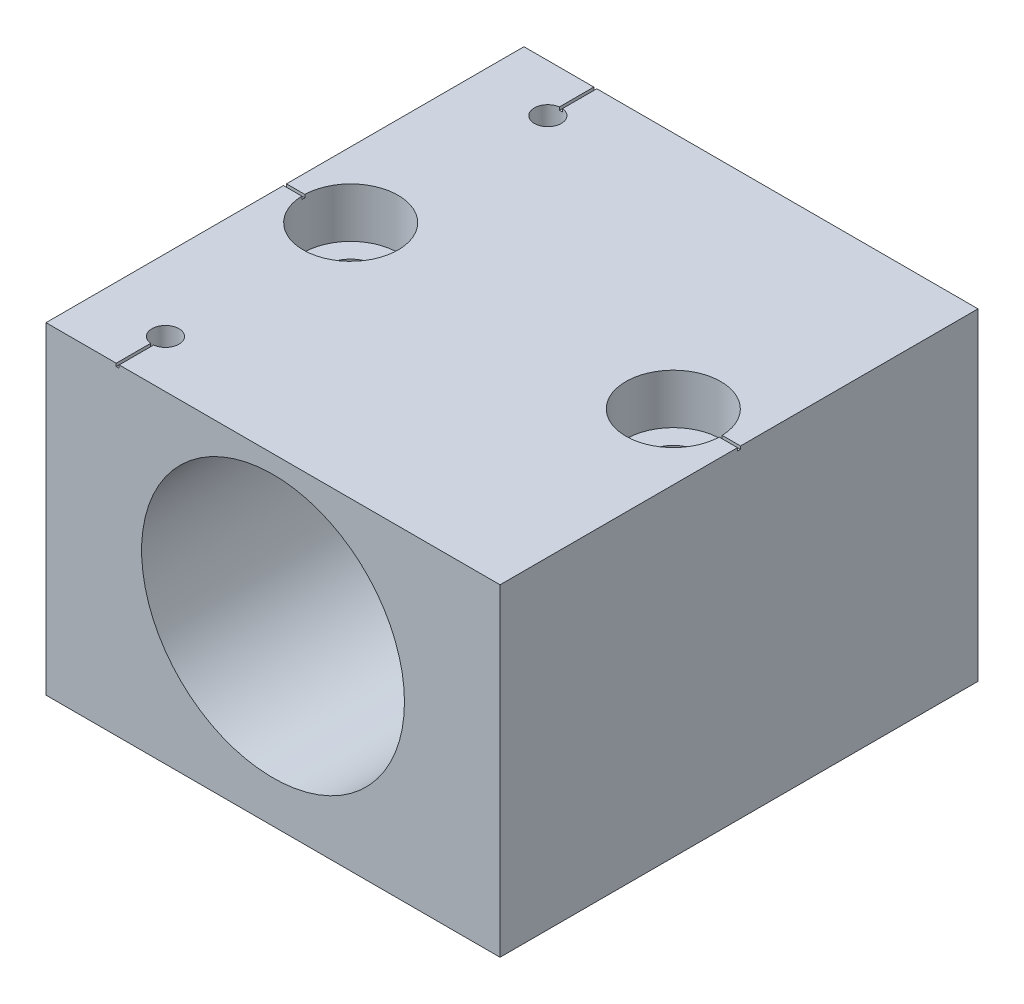
ISO-10303-21;
HEADER;
FILE_DESCRIPTION(('STEP AP214'),'2;1');
FILE_NAME('part.step','',(''),(''),'','','');
FILE_SCHEMA(('AUTOMOTIVE_DESIGN { 1 0 10303 214 1 1 1 1 }'));
ENDSEC;
DATA;
#1=APPLICATION_CONTEXT('core data for automotive mechanical design processes');
#2=APPLICATION_PROTOCOL_DEFINITION('international standard','automotive_design',2000,#1);
#3=PRODUCT_CONTEXT('',#1,'mechanical');
#4=PRODUCT('Part','Part','',(#3));
#5=PRODUCT_RELATED_PRODUCT_CATEGORY('part','',(#4));
#6=PRODUCT_DEFINITION_FORMATION('','',#4);
#7=PRODUCT_DEFINITION_CONTEXT('part definition',#1,'design');
#8=PRODUCT_DEFINITION('design','',#6,#7);
#9=PRODUCT_DEFINITION_SHAPE('','',#8);
#10=(LENGTH_UNIT() NAMED_UNIT(*) SI_UNIT(.MILLI.,.METRE.));
#11=(NAMED_UNIT(*) PLANE_ANGLE_UNIT() SI_UNIT($,.RADIAN.));
#12=(NAMED_UNIT(*) SI_UNIT($,.STERADIAN.) SOLID_ANGLE_UNIT());
#13=UNCERTAINTY_MEASURE_WITH_UNIT(LENGTH_MEASURE(1.E-05),#10,'distance_accuracy_value','');
#14=(GEOMETRIC_REPRESENTATION_CONTEXT(3) GLOBAL_UNCERTAINTY_ASSIGNED_CONTEXT((#13)) GLOBAL_UNIT_ASSIGNED_CONTEXT((#10,
#11,#12)) REPRESENTATION_CONTEXT('',''));
#15=CARTESIAN_POINT('',(0.,0.,0.));
#16=DIRECTION('',(0.,0.,1.));
#17=DIRECTION('',(1.,0.,0.));
#18=AXIS2_PLACEMENT_3D('',#15,#16,#17);
#19=CARTESIAN_POINT('',(-19.,0.,20.));
#20=DIRECTION('',(1.,0.,0.));
#21=DIRECTION('',(0.,0.,-1.));
#22=AXIS2_PLACEMENT_3D('',#19,#20,#21);
#23=PLANE('',#22);
#24=DIRECTION('',(0.,0.,1.));
#25=VECTOR('',#24,1.);
#26=CARTESIAN_POINT('',(-19.,26.75,-0.124999999999956));
#27=LINE('',#26,#25);
#28=CARTESIAN_POINT('',(-19.,26.75,-0.124999999999956));
#29=VERTEX_POINT('',#28);
#30=CARTESIAN_POINT('',(-19.,26.75,0.125000000000043));
#31=VERTEX_POINT('',#30);
#32=EDGE_CURVE('E420',#29,#31,#27,.T.);
#33=ORIENTED_EDGE('',*,*,#32,.F.);
#34=DIRECTION('',(0.,1.,0.));
#35=VECTOR('',#34,1.);
#36=CARTESIAN_POINT('',(-19.,26.75,-0.124999999999956));
#37=LINE('',#36,#35);
#38=CARTESIAN_POINT('',(-19.,27.,-0.124999999999956));
#39=VERTEX_POINT('',#38);
#40=EDGE_CURVE('E347',#29,#39,#37,.T.);
#41=ORIENTED_EDGE('',*,*,#40,.T.);
#42=DIRECTION('',(0.,0.,-1.));
#43=VECTOR('',#42,1.);
#44=CARTESIAN_POINT('',(-19.,27.,20.));
#45=LINE('',#44,#43);
#46=CARTESIAN_POINT('',(-19.,27.,-20.));
#47=VERTEX_POINT('',#46);
#48=EDGE_CURVE('E367',#39,#47,#45,.T.);
#49=ORIENTED_EDGE('',*,*,#48,.T.);
#50=DIRECTION('',(0.,-1.,0.));
#51=VECTOR('',#50,1.);
#52=CARTESIAN_POINT('',(-19.,0.,-20.));
#53=LINE('',#52,#51);
#54=CARTESIAN_POINT('',(-19.,0.,-20.));
#55=VERTEX_POINT('',#54);
#56=EDGE_CURVE('E511',#47,#55,#53,.T.);
#57=ORIENTED_EDGE('',*,*,#56,.T.);
#58=DIRECTION('',(0.,0.,-1.));
#59=VECTOR('',#58,1.);
#60=CARTESIAN_POINT('',(-19.,0.,20.));
#61=LINE('',#60,#59);
#62=CARTESIAN_POINT('',(-19.,0.,20.));
#63=VERTEX_POINT('',#62);
#64=EDGE_CURVE('E379',#63,#55,#61,.T.);
#65=ORIENTED_EDGE('',*,*,#64,.F.);
#66=DIRECTION('',(0.,-1.,0.));
#67=VECTOR('',#66,1.);
#68=CARTESIAN_POINT('',(-19.,0.,20.));
#69=LINE('',#68,#67);
#70=CARTESIAN_POINT('',(-19.,27.,20.));
#71=VERTEX_POINT('',#70);
#72=EDGE_CURVE('E365',#71,#63,#69,.T.);
#73=ORIENTED_EDGE('',*,*,#72,.F.);
#74=CARTESIAN_POINT('',(-19.,27.,0.125000000000044));
#75=VERTEX_POINT('',#74);
#76=EDGE_CURVE('E356',#71,#75,#45,.T.);
#77=ORIENTED_EDGE('',*,*,#76,.T.);
#78=DIRECTION('',(0.,1.,0.));
#79=VECTOR('',#78,1.);
#80=CARTESIAN_POINT('',(-19.,26.75,0.125000000000043));
#81=LINE('',#80,#79);
#82=EDGE_CURVE('E339',#31,#75,#81,.T.);
#83=ORIENTED_EDGE('',*,*,#82,.F.);
#84=EDGE_LOOP('',(#33,#41,#49,#57,#65,#73,#77,#83));
#85=FACE_BOUND('',#84,.T.);
#86=ADVANCED_FACE('F198',(#85),#23,.F.);
#87=CARTESIAN_POINT('',(-19.,0.,20.));
#88=DIRECTION('',(0.,1.,0.));
#89=DIRECTION('',(0.,0.,1.));
#90=AXIS2_PLACEMENT_3D('',#87,#88,#89);
#91=PLANE('',#90);
#92=CARTESIAN_POINT('',(-13.5,0.,0.));
#93=DIRECTION('',(0.,1.,0.));
#94=DIRECTION('',(0.,0.,1.));
#95=AXIS2_PLACEMENT_3D('',#92,#93,#94);
#96=CIRCLE('',#95,2.15264999999999);
#97=CARTESIAN_POINT('',(-13.5,0.,2.15265));
#98=VERTEX_POINT('',#97);
#99=EDGE_CURVE('E469',#98,#98,#96,.T.);
#100=ORIENTED_EDGE('',*,*,#99,.T.);
#101=EDGE_LOOP('',(#100));
#102=FACE_BOUND('',#101,.T.);
#103=CARTESIAN_POINT('',(13.5,0.,0.));
#104=DIRECTION('',(0.,1.,0.));
#105=DIRECTION('',(0.,0.,1.));
#106=AXIS2_PLACEMENT_3D('',#103,#104,#105);
#107=CIRCLE('',#106,2.15264999999999);
#108=CARTESIAN_POINT('',(13.5,0.,2.15264999999999));
#109=VERTEX_POINT('',#108);
#110=EDGE_CURVE('E481',#109,#109,#107,.T.);
#111=ORIENTED_EDGE('',*,*,#110,.T.);
#112=EDGE_LOOP('',(#111));
#113=FACE_BOUND('',#112,.T.);
#114=DIRECTION('',(1.,0.,0.));
#115=VECTOR('',#114,1.);
#116=CARTESIAN_POINT('',(-19.,0.,-20.));
#117=LINE('',#116,#115);
#118=CARTESIAN_POINT('',(19.,0.,-20.));
#119=VERTEX_POINT('',#118);
#120=EDGE_CURVE('E514',#55,#119,#117,.T.);
#121=ORIENTED_EDGE('',*,*,#120,.T.);
#122=DIRECTION('',(0.,0.,-1.));
#123=VECTOR('',#122,1.);
#124=CARTESIAN_POINT('',(19.,0.,20.));
#125=LINE('',#124,#123);
#126=CARTESIAN_POINT('',(19.,0.,20.));
#127=VERTEX_POINT('',#126);
#128=EDGE_CURVE('E376',#127,#119,#125,.T.);
#129=ORIENTED_EDGE('',*,*,#128,.F.);
#130=DIRECTION('',(1.,0.,0.));
#131=VECTOR('',#130,1.);
#132=CARTESIAN_POINT('',(-19.,0.,20.));
#133=LINE('',#132,#131);
#134=EDGE_CURVE('E524',#63,#127,#133,.T.);
#135=ORIENTED_EDGE('',*,*,#134,.F.);
#136=ORIENTED_EDGE('',*,*,#64,.T.);
#137=EDGE_LOOP('',(#121,#129,#135,#136));
#138=FACE_BOUND('',#137,.T.);
#139=ADVANCED_FACE('F563',(#102,#113,#138),#91,.F.);
#140=CARTESIAN_POINT('',(19.,0.,20.));
#141=DIRECTION('',(-1.,0.,0.));
#142=DIRECTION('',(0.,0.,1.));
#143=AXIS2_PLACEMENT_3D('',#140,#141,#142);
#144=PLANE('',#143);
#145=DIRECTION('',(0.,0.,-1.));
#146=VECTOR('',#145,1.);
#147=CARTESIAN_POINT('',(19.,26.75,-0.124999999999961));
#148=LINE('',#147,#146);
#149=CARTESIAN_POINT('',(19.,26.75,0.125000000000039));
#150=VERTEX_POINT('',#149);
#151=CARTESIAN_POINT('',(19.,26.75,-0.124999999999961));
#152=VERTEX_POINT('',#151);
#153=EDGE_CURVE('E429',#150,#152,#148,.T.);
#154=ORIENTED_EDGE('',*,*,#153,.F.);
#155=DIRECTION('',(0.,1.,0.));
#156=VECTOR('',#155,1.);
#157=CARTESIAN_POINT('',(19.,26.75,0.125000000000039));
#158=LINE('',#157,#156);
#159=CARTESIAN_POINT('',(19.,27.,0.125000000000039));
#160=VERTEX_POINT('',#159);
#161=EDGE_CURVE('E435',#150,#160,#158,.T.);
#162=ORIENTED_EDGE('',*,*,#161,.T.);
#163=DIRECTION('',(0.,0.,-1.));
#164=VECTOR('',#163,1.);
#165=CARTESIAN_POINT('',(19.,27.,20.));
#166=LINE('',#165,#164);
#167=CARTESIAN_POINT('',(19.,27.,20.));
#168=VERTEX_POINT('',#167);
#169=EDGE_CURVE('E369',#168,#160,#166,.T.);
#170=ORIENTED_EDGE('',*,*,#169,.F.);
#171=DIRECTION('',(0.,1.,0.));
#172=VECTOR('',#171,1.);
#173=CARTESIAN_POINT('',(19.,0.,20.));
#174=LINE('',#173,#172);
#175=EDGE_CURVE('E525',#127,#168,#174,.T.);
#176=ORIENTED_EDGE('',*,*,#175,.F.);
#177=ORIENTED_EDGE('',*,*,#128,.T.);
#178=DIRECTION('',(0.,1.,0.));
#179=VECTOR('',#178,1.);
#180=CARTESIAN_POINT('',(19.,0.,-20.));
#181=LINE('',#180,#179);
#182=CARTESIAN_POINT('',(19.,27.,-20.));
#183=VERTEX_POINT('',#182);
#184=EDGE_CURVE('E516',#119,#183,#181,.T.);
#185=ORIENTED_EDGE('',*,*,#184,.T.);
#186=CARTESIAN_POINT('',(19.,27.,-0.124999999999961));
#187=VERTEX_POINT('',#186);
#188=EDGE_CURVE('E366',#187,#183,#166,.T.);
#189=ORIENTED_EDGE('',*,*,#188,.F.);
#190=DIRECTION('',(0.,1.,0.));
#191=VECTOR('',#190,1.);
#192=CARTESIAN_POINT('',(19.,26.75,-0.124999999999961));
#193=LINE('',#192,#191);
#194=EDGE_CURVE('E434',#152,#187,#193,.T.);
#195=ORIENTED_EDGE('',*,*,#194,.F.);
#196=EDGE_LOOP('',(#154,#162,#170,#176,#177,#185,#189,#195));
#197=FACE_BOUND('',#196,.T.);
#198=ADVANCED_FACE('F567',(#197),#144,.F.);
#199=CARTESIAN_POINT('',(-19.,27.,20.));
#200=DIRECTION('',(0.,-1.,0.));
#201=DIRECTION('',(0.,0.,-1.));
#202=AXIS2_PLACEMENT_3D('',#199,#200,#201);
#203=PLANE('',#202);
#204=ORIENTED_EDGE('',*,*,#48,.F.);
#205=DIRECTION('',(-1.,0.,0.));
#206=VECTOR('',#205,1.);
#207=CARTESIAN_POINT('',(-19.,27.,-0.124999999999956));
#208=LINE('',#207,#206);
#209=CARTESIAN_POINT('',(-17.4667810076307,27.,-0.124999999999956));
#210=VERTEX_POINT('',#209);
#211=EDGE_CURVE('E361',#210,#39,#208,.T.);
#212=ORIENTED_EDGE('',*,*,#211,.F.);
#213=CARTESIAN_POINT('',(-13.5,27.,0.));
#214=DIRECTION('',(0.,1.,0.));
#215=DIRECTION('',(0.,0.,1.));
#216=AXIS2_PLACEMENT_3D('',#213,#214,#215);
#217=CIRCLE('',#216,3.96875);
#218=CARTESIAN_POINT('',(-17.4667810076307,27.,0.125000000000044));
#219=VERTEX_POINT('',#218);
#220=EDGE_CURVE('E360',#219,#210,#217,.T.);
#221=ORIENTED_EDGE('',*,*,#220,.F.);
#222=DIRECTION('',(1.,0.,0.));
#223=VECTOR('',#222,1.);
#224=CARTESIAN_POINT('',(-19.,27.,0.125000000000044));
#225=LINE('',#224,#223);
#226=EDGE_CURVE('E342',#75,#219,#225,.T.);
#227=ORIENTED_EDGE('',*,*,#226,.F.);
#228=ORIENTED_EDGE('',*,*,#76,.F.);
#229=DIRECTION('',(-1.,0.,0.));
#230=VECTOR('',#229,1.);
#231=CARTESIAN_POINT('',(-19.,27.,20.));
#232=LINE('',#231,#230);
#233=CARTESIAN_POINT('',(-13.1230905266915,27.,20.));
#234=VERTEX_POINT('',#233);
#235=EDGE_CURVE('E526',#234,#71,#232,.T.);
#236=ORIENTED_EDGE('',*,*,#235,.F.);
#237=DIRECTION('',(0.,0.,1.));
#238=VECTOR('',#237,1.);
#239=CARTESIAN_POINT('',(-13.1230905266915,27.,20.));
#240=LINE('',#239,#238);
#241=CARTESIAN_POINT('',(-13.1230905266915,27.,17.123577684114));
#242=VERTEX_POINT('',#241);
#243=EDGE_CURVE('E438',#242,#234,#240,.T.);
#244=ORIENTED_EDGE('',*,*,#243,.F.);
#245=CARTESIAN_POINT('',(-13.,27.,16.));
#246=DIRECTION('',(0.,1.,0.));
#247=DIRECTION('',(0.,0.,1.));
#248=AXIS2_PLACEMENT_3D('',#245,#246,#247);
#249=CIRCLE('',#248,1.1303);
#250=CARTESIAN_POINT('',(-12.8730905266915,27.,17.1231527392054));
#251=VERTEX_POINT('',#250);
#252=EDGE_CURVE('E502',#251,#242,#249,.T.);
#253=ORIENTED_EDGE('',*,*,#252,.F.);
#254=DIRECTION('',(0.,0.,-1.));
#255=VECTOR('',#254,1.);
#256=CARTESIAN_POINT('',(-12.8730905266915,27.,20.));
#257=LINE('',#256,#255);
#258=CARTESIAN_POINT('',(-12.8730905266915,27.,20.));
#259=VERTEX_POINT('',#258);
#260=EDGE_CURVE('E441',#259,#251,#257,.T.);
#261=ORIENTED_EDGE('',*,*,#260,.F.);
#262=EDGE_CURVE('E371',#168,#259,#232,.T.);
#263=ORIENTED_EDGE('',*,*,#262,.F.);
#264=ORIENTED_EDGE('',*,*,#169,.T.);
#265=DIRECTION('',(1.,0.,0.));
#266=VECTOR('',#265,1.);
#267=CARTESIAN_POINT('',(19.,27.,0.125000000000039));
#268=LINE('',#267,#266);
#269=CARTESIAN_POINT('',(17.4667810076307,27.,0.12500000000004));
#270=VERTEX_POINT('',#269);
#271=EDGE_CURVE('E427',#270,#160,#268,.T.);
#272=ORIENTED_EDGE('',*,*,#271,.F.);
#273=CARTESIAN_POINT('',(13.5,27.,0.));
#274=DIRECTION('',(0.,1.,0.));
#275=DIRECTION('',(0.,0.,1.));
#276=AXIS2_PLACEMENT_3D('',#273,#274,#275);
#277=CIRCLE('',#276,3.96875);
#278=CARTESIAN_POINT('',(17.4667810076307,27.,-0.124999999999961));
#279=VERTEX_POINT('',#278);
#280=EDGE_CURVE('E490',#279,#270,#277,.T.);
#281=ORIENTED_EDGE('',*,*,#280,.F.);
#282=DIRECTION('',(-1.,0.,0.));
#283=VECTOR('',#282,1.);
#284=CARTESIAN_POINT('',(19.,27.,-0.124999999999961));
#285=LINE('',#284,#283);
#286=EDGE_CURVE('E424',#187,#279,#285,.T.);
#287=ORIENTED_EDGE('',*,*,#286,.F.);
#288=ORIENTED_EDGE('',*,*,#188,.T.);
#289=DIRECTION('',(-1.,0.,0.));
#290=VECTOR('',#289,1.);
#291=CARTESIAN_POINT('',(-19.,27.,-20.));
#292=LINE('',#291,#290);
#293=CARTESIAN_POINT('',(-12.9014502639933,27.,-20.));
#294=VERTEX_POINT('',#293);
#295=EDGE_CURVE('E520',#183,#294,#292,.T.);
#296=ORIENTED_EDGE('',*,*,#295,.T.);
#297=DIRECTION('',(0.,0.,-1.));
#298=VECTOR('',#297,1.);
#299=CARTESIAN_POINT('',(-12.9014502639933,27.,-20.));
#300=LINE('',#299,#298);
#301=CARTESIAN_POINT('',(-12.9014502639933,27.,-17.1259955770485));
#302=VERTEX_POINT('',#301);
#303=EDGE_CURVE('E457',#302,#294,#300,.T.);
#304=ORIENTED_EDGE('',*,*,#303,.F.);
#305=CARTESIAN_POINT('',(-13.,27.,-16.));
#306=DIRECTION('',(0.,1.,0.));
#307=DIRECTION('',(0.,0.,1.));
#308=AXIS2_PLACEMENT_3D('',#305,#306,#307);
#309=CIRCLE('',#308,1.1303);
#310=CARTESIAN_POINT('',(-13.1514502639933,27.,-17.1201075428441));
#311=VERTEX_POINT('',#310);
#312=EDGE_CURVE('E496',#311,#302,#309,.T.);
#313=ORIENTED_EDGE('',*,*,#312,.F.);
#314=DIRECTION('',(0.,0.,1.));
#315=VECTOR('',#314,1.);
#316=CARTESIAN_POINT('',(-13.1514502639933,27.,-20.));
#317=LINE('',#316,#315);
#318=CARTESIAN_POINT('',(-13.1514502639933,27.,-20.));
#319=VERTEX_POINT('',#318);
#320=EDGE_CURVE('E453',#319,#311,#317,.T.);
#321=ORIENTED_EDGE('',*,*,#320,.F.);
#322=EDGE_CURVE('E519',#319,#47,#292,.T.);
#323=ORIENTED_EDGE('',*,*,#322,.T.);
#324=EDGE_LOOP('',(#204,#212,#221,#227,#228,#236,#244,#253,#261,#263,#264,#272,#281,#287,#288,
#296,#304,#313,#321,#323));
#325=FACE_BOUND('',#324,.T.);
#326=ADVANCED_FACE('F354',(#325),#203,.F.);
#327=CARTESIAN_POINT('',(-19.,27.,20.));
#328=DIRECTION('',(0.,0.,-1.));
#329=DIRECTION('',(-1.,0.,0.));
#330=AXIS2_PLACEMENT_3D('',#327,#328,#329);
#331=PLANE('',#330);
#332=CARTESIAN_POINT('',(0.,14.5,20.));
#333=DIRECTION('',(0.,0.,1.));
#334=DIRECTION('',(1.,0.,0.));
#335=AXIS2_PLACEMENT_3D('',#332,#333,#334);
#336=CIRCLE('',#335,11.);
#337=CARTESIAN_POINT('',(11.,14.5,20.));
#338=VERTEX_POINT('',#337);
#339=EDGE_CURVE('E505',#338,#338,#336,.T.);
#340=ORIENTED_EDGE('',*,*,#339,.F.);
#341=EDGE_LOOP('',(#340));
#342=FACE_BOUND('',#341,.T.);
#343=DIRECTION('',(1.,0.,0.));
#344=VECTOR('',#343,1.);
#345=CARTESIAN_POINT('',(-13.1230905266915,26.75,20.));
#346=LINE('',#345,#344);
#347=CARTESIAN_POINT('',(-13.1230905266915,26.75,20.));
#348=VERTEX_POINT('',#347);
#349=CARTESIAN_POINT('',(-12.8730905266915,26.75,20.));
#350=VERTEX_POINT('',#349);
#351=EDGE_CURVE('E445',#348,#350,#346,.T.);
#352=ORIENTED_EDGE('',*,*,#351,.F.);
#353=DIRECTION('',(0.,1.,0.));
#354=VECTOR('',#353,1.);
#355=CARTESIAN_POINT('',(-13.1230905266915,26.75,20.));
#356=LINE('',#355,#354);
#357=EDGE_CURVE('E450',#348,#234,#356,.T.);
#358=ORIENTED_EDGE('',*,*,#357,.T.);
#359=ORIENTED_EDGE('',*,*,#235,.T.);
#360=ORIENTED_EDGE('',*,*,#72,.T.);
#361=ORIENTED_EDGE('',*,*,#134,.T.);
#362=ORIENTED_EDGE('',*,*,#175,.T.);
#363=ORIENTED_EDGE('',*,*,#262,.T.);
#364=DIRECTION('',(0.,1.,0.));
#365=VECTOR('',#364,1.);
#366=CARTESIAN_POINT('',(-12.8730905266915,26.75,20.));
#367=LINE('',#366,#365);
#368=EDGE_CURVE('E451',#350,#259,#367,.T.);
#369=ORIENTED_EDGE('',*,*,#368,.F.);
#370=EDGE_LOOP('',(#352,#358,#359,#360,#361,#362,#363,#369));
#371=FACE_BOUND('',#370,.T.);
#372=ADVANCED_FACE('F534',(#342,#371),#331,.F.);
#373=CARTESIAN_POINT('',(-19.,27.,-20.));
#374=DIRECTION('',(0.,0.,-1.));
#375=DIRECTION('',(-1.,0.,0.));
#376=AXIS2_PLACEMENT_3D('',#373,#374,#375);
#377=PLANE('',#376);
#378=DIRECTION('',(0.,1.,0.));
#379=VECTOR('',#378,1.);
#380=CARTESIAN_POINT('',(-13.1514502639933,26.75,-20.));
#381=LINE('',#380,#379);
#382=CARTESIAN_POINT('',(-13.1514502639933,26.75,-20.));
#383=VERTEX_POINT('',#382);
#384=EDGE_CURVE('E467',#383,#319,#381,.T.);
#385=ORIENTED_EDGE('',*,*,#384,.F.);
#386=DIRECTION('',(-1.,0.,0.));
#387=VECTOR('',#386,1.);
#388=CARTESIAN_POINT('',(-13.1514502639933,26.75,-20.));
#389=LINE('',#388,#387);
#390=CARTESIAN_POINT('',(-12.9014502639933,26.75,-20.));
#391=VERTEX_POINT('',#390);
#392=EDGE_CURVE('E463',#391,#383,#389,.T.);
#393=ORIENTED_EDGE('',*,*,#392,.F.);
#394=DIRECTION('',(0.,1.,0.));
#395=VECTOR('',#394,1.);
#396=CARTESIAN_POINT('',(-12.9014502639933,26.75,-20.));
#397=LINE('',#396,#395);
#398=EDGE_CURVE('E466',#391,#294,#397,.T.);
#399=ORIENTED_EDGE('',*,*,#398,.T.);
#400=ORIENTED_EDGE('',*,*,#295,.F.);
#401=ORIENTED_EDGE('',*,*,#184,.F.);
#402=ORIENTED_EDGE('',*,*,#120,.F.);
#403=ORIENTED_EDGE('',*,*,#56,.F.);
#404=ORIENTED_EDGE('',*,*,#322,.F.);
#405=EDGE_LOOP('',(#385,#393,#399,#400,#401,#402,#403,#404));
#406=FACE_BOUND('',#405,.T.);
#407=CARTESIAN_POINT('',(0.,14.5,-20.));
#408=DIRECTION('',(0.,0.,1.));
#409=DIRECTION('',(1.,0.,0.));
#410=AXIS2_PLACEMENT_3D('',#407,#408,#409);
#411=CIRCLE('',#410,11.);
#412=CARTESIAN_POINT('',(11.,14.5,-20.));
#413=VERTEX_POINT('',#412);
#414=EDGE_CURVE('E508',#413,#413,#411,.T.);
#415=ORIENTED_EDGE('',*,*,#414,.T.);
#416=EDGE_LOOP('',(#415));
#417=FACE_BOUND('',#416,.T.);
#418=ADVANCED_FACE('F580',(#406,#417),#377,.T.);
#419=CARTESIAN_POINT('',(0.,14.5,-20.));
#420=DIRECTION('',(0.,0.,1.));
#421=DIRECTION('',(1.,0.,0.));
#422=AXIS2_PLACEMENT_3D('',#419,#420,#421);
#423=CYLINDRICAL_SURFACE('',#422,11.);
#424=ORIENTED_EDGE('',*,*,#414,.F.);
#425=EDGE_LOOP('',(#424));
#426=FACE_BOUND('',#425,.T.);
#427=ORIENTED_EDGE('',*,*,#339,.T.);
#428=EDGE_LOOP('',(#427));
#429=FACE_BOUND('',#428,.T.);
#430=ADVANCED_FACE('F584',(#426,#429),#423,.F.);
#431=CARTESIAN_POINT('',(-13.,27.,16.));
#432=DIRECTION('',(0.,1.,0.));
#433=DIRECTION('',(0.,0.,1.));
#434=AXIS2_PLACEMENT_3D('',#431,#432,#433);
#435=CYLINDRICAL_SURFACE('',#434,1.13029999999999);
#436=ORIENTED_EDGE('',*,*,#252,.T.);
#437=DIRECTION('',(0.,1.,0.));
#438=VECTOR('',#437,1.);
#439=CARTESIAN_POINT('',(-13.1230905266915,27.,17.123577684114));
#440=LINE('',#439,#438);
#441=CARTESIAN_POINT('',(-13.1230905266915,26.75,17.123577684114));
#442=VERTEX_POINT('',#441);
#443=EDGE_CURVE('E396',#242,#442,#440,.F.);
#444=ORIENTED_EDGE('',*,*,#443,.T.);
#445=CARTESIAN_POINT('',(-13.,26.75,16.));
#446=DIRECTION('',(0.,-1.,0.));
#447=DIRECTION('',(0.,0.,-1.));
#448=AXIS2_PLACEMENT_3D('',#445,#446,#447);
#449=CIRCLE('',#448,1.13029999999999);
#450=CARTESIAN_POINT('',(-12.8730905266915,26.75,17.1231527392054));
#451=VERTEX_POINT('',#450);
#452=EDGE_CURVE('E390',#442,#451,#449,.F.);
#453=ORIENTED_EDGE('',*,*,#452,.T.);
#454=DIRECTION('',(0.,1.,0.));
#455=VECTOR('',#454,1.);
#456=CARTESIAN_POINT('',(-12.8730905266915,27.,17.1231527392054));
#457=LINE('',#456,#455);
#458=EDGE_CURVE('E393',#451,#251,#457,.T.);
#459=ORIENTED_EDGE('',*,*,#458,.T.);
#460=EDGE_LOOP('',(#436,#444,#453,#459));
#461=FACE_BOUND('',#460,.T.);
#462=CARTESIAN_POINT('',(-13.,18.1354,16.));
#463=DIRECTION('',(0.,1.,0.));
#464=DIRECTION('',(0.,0.,1.));
#465=AXIS2_PLACEMENT_3D('',#462,#463,#464);
#466=CIRCLE('',#465,1.13029999999999);
#467=CARTESIAN_POINT('',(-13.,18.1354,17.1303));
#468=VERTEX_POINT('',#467);
#469=EDGE_CURVE('E499',#468,#468,#466,.T.);
#470=ORIENTED_EDGE('',*,*,#469,.F.);
#471=EDGE_LOOP('',(#470));
#472=FACE_BOUND('',#471,.T.);
#473=ADVANCED_FACE('F543',(#461,#472),#435,.F.);
#474=CARTESIAN_POINT('',(-13.,18.1354,16.));
#475=DIRECTION('',(0.,1.,0.));
#476=DIRECTION('',(0.,0.,1.));
#477=AXIS2_PLACEMENT_3D('',#474,#475,#476);
#478=CONICAL_SURFACE('',#477,1.13029999999999,1.02974425867665);
#479=CARTESIAN_POINT('',(-13.,17.4562472423132,16.));
#480=VERTEX_POINT('',#479);
#481=VERTEX_LOOP('',#480);
#482=FACE_BOUND('',#481,.T.);
#483=ORIENTED_EDGE('',*,*,#469,.T.);
#484=EDGE_LOOP('',(#483));
#485=FACE_BOUND('',#484,.T.);
#486=ADVANCED_FACE('F591',(#482,#485),#478,.F.);
#487=CARTESIAN_POINT('',(-13.,27.,-16.));
#488=DIRECTION('',(0.,1.,0.));
#489=DIRECTION('',(0.,0.,1.));
#490=AXIS2_PLACEMENT_3D('',#487,#488,#489);
#491=CYLINDRICAL_SURFACE('',#490,1.13029999999999);
#492=CARTESIAN_POINT('',(-13.,18.1354,-16.));
#493=DIRECTION('',(0.,1.,0.));
#494=DIRECTION('',(0.,0.,1.));
#495=AXIS2_PLACEMENT_3D('',#492,#493,#494);
#496=CIRCLE('',#495,1.13029999999999);
#497=CARTESIAN_POINT('',(-13.,18.1354,-14.8697));
#498=VERTEX_POINT('',#497);
#499=EDGE_CURVE('E493',#498,#498,#496,.T.);
#500=ORIENTED_EDGE('',*,*,#499,.F.);
#501=EDGE_LOOP('',(#500));
#502=FACE_BOUND('',#501,.T.);
#503=CARTESIAN_POINT('',(-13.,26.75,-16.));
#504=DIRECTION('',(0.,1.,0.));
#505=DIRECTION('',(0.,0.,1.));
#506=AXIS2_PLACEMENT_3D('',#503,#504,#505);
#507=CIRCLE('',#506,1.13029999999999);
#508=CARTESIAN_POINT('',(-13.1514502639933,26.75,-17.1201075428441));
#509=VERTEX_POINT('',#508);
#510=CARTESIAN_POINT('',(-12.9014502639933,26.75,-17.1259955770485));
#511=VERTEX_POINT('',#510);
#512=EDGE_CURVE('E382',#509,#511,#507,.F.);
#513=ORIENTED_EDGE('',*,*,#512,.F.);
#514=DIRECTION('',(0.,1.,0.));
#515=VECTOR('',#514,1.);
#516=CARTESIAN_POINT('',(-13.1514502639933,27.,-17.1201075428441));
#517=LINE('',#516,#515);
#518=EDGE_CURVE('E387',#509,#311,#517,.T.);
#519=ORIENTED_EDGE('',*,*,#518,.T.);
#520=ORIENTED_EDGE('',*,*,#312,.T.);
#521=DIRECTION('',(0.,1.,0.));
#522=VECTOR('',#521,1.);
#523=CARTESIAN_POINT('',(-12.9014502639933,27.,-17.1259955770485));
#524=LINE('',#523,#522);
#525=EDGE_CURVE('E384',#302,#511,#524,.F.);
#526=ORIENTED_EDGE('',*,*,#525,.T.);
#527=EDGE_LOOP('',(#513,#519,#520,#526));
#528=FACE_BOUND('',#527,.T.);
#529=ADVANCED_FACE('F594',(#502,#528),#491,.F.);
#530=CARTESIAN_POINT('',(-13.,18.1354,-16.));
#531=DIRECTION('',(0.,1.,0.));
#532=DIRECTION('',(0.,0.,1.));
#533=AXIS2_PLACEMENT_3D('',#530,#531,#532);
#534=CONICAL_SURFACE('',#533,1.13029999999999,1.02974425867665);
#535=CARTESIAN_POINT('',(-13.,17.4562472423132,-16.));
#536=VERTEX_POINT('',#535);
#537=VERTEX_LOOP('',#536);
#538=FACE_BOUND('',#537,.T.);
#539=ORIENTED_EDGE('',*,*,#499,.T.);
#540=EDGE_LOOP('',(#539));
#541=FACE_BOUND('',#540,.T.);
#542=ADVANCED_FACE('F598',(#538,#541),#534,.F.);
#543=CARTESIAN_POINT('',(13.5,27.,0.));
#544=DIRECTION('',(0.,1.,0.));
#545=DIRECTION('',(0.,0.,1.));
#546=AXIS2_PLACEMENT_3D('',#543,#544,#545);
#547=CYLINDRICAL_SURFACE('',#546,3.96875);
#548=ORIENTED_EDGE('',*,*,#280,.T.);
#549=DIRECTION('',(0.,1.,0.));
#550=VECTOR('',#549,1.);
#551=CARTESIAN_POINT('',(17.4667810076307,27.,0.12500000000004));
#552=LINE('',#551,#550);
#553=CARTESIAN_POINT('',(17.4667810076307,26.75,0.125000000000039));
#554=VERTEX_POINT('',#553);
#555=EDGE_CURVE('E405',#270,#554,#552,.F.);
#556=ORIENTED_EDGE('',*,*,#555,.T.);
#557=CARTESIAN_POINT('',(13.5,26.75,0.));
#558=DIRECTION('',(0.,-1.,0.));
#559=DIRECTION('',(0.,0.,-1.));
#560=AXIS2_PLACEMENT_3D('',#557,#558,#559);
#561=CIRCLE('',#560,3.96875);
#562=CARTESIAN_POINT('',(17.4667810076307,26.75,-0.124999999999961));
#563=VERTEX_POINT('',#562);
#564=EDGE_CURVE('E399',#554,#563,#561,.F.);
#565=ORIENTED_EDGE('',*,*,#564,.T.);
#566=DIRECTION('',(0.,1.,0.));
#567=VECTOR('',#566,1.);
#568=CARTESIAN_POINT('',(17.4667810076307,27.,-0.124999999999961));
#569=LINE('',#568,#567);
#570=EDGE_CURVE('E402',#563,#279,#569,.T.);
#571=ORIENTED_EDGE('',*,*,#570,.T.);
#572=EDGE_LOOP('',(#548,#556,#565,#571));
#573=FACE_BOUND('',#572,.T.);
#574=CARTESIAN_POINT('',(13.5,22.8344,0.));
#575=DIRECTION('',(0.,1.,0.));
#576=DIRECTION('',(0.,0.,1.));
#577=AXIS2_PLACEMENT_3D('',#574,#575,#576);
#578=CIRCLE('',#577,3.96875);
#579=CARTESIAN_POINT('',(13.5,22.8344,3.96875000000003));
#580=VERTEX_POINT('',#579);
#581=EDGE_CURVE('E487',#580,#580,#578,.T.);
#582=ORIENTED_EDGE('',*,*,#581,.F.);
#583=EDGE_LOOP('',(#582));
#584=FACE_BOUND('',#583,.T.);
#585=ADVANCED_FACE('F602',(#573,#584),#547,.F.);
#586=CARTESIAN_POINT('',(15.65265,22.8344,0.));
#587=DIRECTION('',(0.,-1.,0.));
#588=DIRECTION('',(0.,0.,-1.));
#589=AXIS2_PLACEMENT_3D('',#586,#587,#588);
#590=PLANE('',#589);
#591=CARTESIAN_POINT('',(13.5,22.8344,0.));
#592=DIRECTION('',(0.,1.,0.));
#593=DIRECTION('',(0.,0.,1.));
#594=AXIS2_PLACEMENT_3D('',#591,#592,#593);
#595=CIRCLE('',#594,2.15265);
#596=CARTESIAN_POINT('',(13.5,22.8344,2.15265000000003));
#597=VERTEX_POINT('',#596);
#598=EDGE_CURVE('E484',#597,#597,#595,.T.);
#599=ORIENTED_EDGE('',*,*,#598,.F.);
#600=EDGE_LOOP('',(#599));
#601=FACE_BOUND('',#600,.T.);
#602=ORIENTED_EDGE('',*,*,#581,.T.);
#603=EDGE_LOOP('',(#602));
#604=FACE_BOUND('',#603,.T.);
#605=ADVANCED_FACE('F606',(#601,#604),#590,.F.);
#606=CARTESIAN_POINT('',(13.5,27.,0.));
#607=DIRECTION('',(0.,1.,0.));
#608=DIRECTION('',(0.,0.,1.));
#609=AXIS2_PLACEMENT_3D('',#606,#607,#608);
#610=CYLINDRICAL_SURFACE('',#609,2.15265);
#611=ORIENTED_EDGE('',*,*,#110,.F.);
#612=EDGE_LOOP('',(#611));
#613=FACE_BOUND('',#612,.T.);
#614=ORIENTED_EDGE('',*,*,#598,.T.);
#615=EDGE_LOOP('',(#614));
#616=FACE_BOUND('',#615,.T.);
#617=ADVANCED_FACE('F610',(#613,#616),#610,.F.);
#618=CARTESIAN_POINT('',(-13.5,27.,0.));
#619=DIRECTION('',(0.,1.,0.));
#620=DIRECTION('',(0.,0.,1.));
#621=AXIS2_PLACEMENT_3D('',#618,#619,#620);
#622=CYLINDRICAL_SURFACE('',#621,3.96875);
#623=ORIENTED_EDGE('',*,*,#220,.T.);
#624=DIRECTION('',(0.,1.,0.));
#625=VECTOR('',#624,1.);
#626=CARTESIAN_POINT('',(-17.4667810076307,27.,-0.124999999999956));
#627=LINE('',#626,#625);
#628=CARTESIAN_POINT('',(-17.4667810076307,26.75,-0.124999999999957));
#629=VERTEX_POINT('',#628);
#630=EDGE_CURVE('E12',#210,#629,#627,.F.);
#631=ORIENTED_EDGE('',*,*,#630,.T.);
#632=CARTESIAN_POINT('',(-13.5,26.75,0.));
#633=DIRECTION('',(0.,1.,0.));
#634=DIRECTION('',(0.,0.,1.));
#635=AXIS2_PLACEMENT_3D('',#632,#633,#634);
#636=CIRCLE('',#635,3.96875);
#637=CARTESIAN_POINT('',(-17.4667810076307,26.75,0.125000000000043));
#638=VERTEX_POINT('',#637);
#639=EDGE_CURVE('E408',#638,#629,#636,.F.);
#640=ORIENTED_EDGE('',*,*,#639,.F.);
#641=DIRECTION('',(0.,1.,0.));
#642=VECTOR('',#641,1.);
#643=CARTESIAN_POINT('',(-17.4667810076307,27.,0.125000000000044));
#644=LINE('',#643,#642);
#645=EDGE_CURVE('E205',#638,#219,#644,.T.);
#646=ORIENTED_EDGE('',*,*,#645,.T.);
#647=EDGE_LOOP('',(#623,#631,#640,#646));
#648=FACE_BOUND('',#647,.T.);
#649=CARTESIAN_POINT('',(-13.5,22.8344,0.));
#650=DIRECTION('',(0.,1.,0.));
#651=DIRECTION('',(0.,0.,1.));
#652=AXIS2_PLACEMENT_3D('',#649,#650,#651);
#653=CIRCLE('',#652,3.96875);
#654=CARTESIAN_POINT('',(-13.5,22.8344,3.96875000000003));
#655=VERTEX_POINT('',#654);
#656=EDGE_CURVE('E477',#655,#655,#653,.T.);
#657=ORIENTED_EDGE('',*,*,#656,.F.);
#658=EDGE_LOOP('',(#657));
#659=FACE_BOUND('',#658,.T.);
#660=ADVANCED_FACE('F411',(#648,#659),#622,.F.);
#661=CARTESIAN_POINT('',(-11.34735,22.8344,0.));
#662=DIRECTION('',(0.,-1.,0.));
#663=DIRECTION('',(0.,0.,-1.));
#664=AXIS2_PLACEMENT_3D('',#661,#662,#663);
#665=PLANE('',#664);
#666=CARTESIAN_POINT('',(-13.5,22.8344,0.));
#667=DIRECTION('',(0.,1.,0.));
#668=DIRECTION('',(0.,0.,1.));
#669=AXIS2_PLACEMENT_3D('',#666,#667,#668);
#670=CIRCLE('',#669,2.15265);
#671=CARTESIAN_POINT('',(-13.5,22.8344,2.15265000000004));
#672=VERTEX_POINT('',#671);
#673=EDGE_CURVE('E474',#672,#672,#670,.T.);
#674=ORIENTED_EDGE('',*,*,#673,.F.);
#675=EDGE_LOOP('',(#674));
#676=FACE_BOUND('',#675,.T.);
#677=ORIENTED_EDGE('',*,*,#656,.T.);
#678=EDGE_LOOP('',(#677));
#679=FACE_BOUND('',#678,.T.);
#680=ADVANCED_FACE('F617',(#676,#679),#665,.F.);
#681=CARTESIAN_POINT('',(-13.5,27.,0.));
#682=DIRECTION('',(0.,1.,0.));
#683=DIRECTION('',(0.,0.,1.));
#684=AXIS2_PLACEMENT_3D('',#681,#682,#683);
#685=CYLINDRICAL_SURFACE('',#684,2.15265);
#686=ORIENTED_EDGE('',*,*,#99,.F.);
#687=EDGE_LOOP('',(#686));
#688=FACE_BOUND('',#687,.T.);
#689=ORIENTED_EDGE('',*,*,#673,.T.);
#690=EDGE_LOOP('',(#689));
#691=FACE_BOUND('',#690,.T.);
#692=ADVANCED_FACE('F620',(#688,#691),#685,.F.);
#693=CARTESIAN_POINT('',(-13.1514502639933,26.75,-20.));
#694=DIRECTION('',(-1.,0.,0.));
#695=DIRECTION('',(0.,0.,1.));
#696=AXIS2_PLACEMENT_3D('',#693,#694,#695);
#697=PLANE('',#696);
#698=DIRECTION('',(0.,0.,1.));
#699=VECTOR('',#698,1.);
#700=CARTESIAN_POINT('',(-13.1514502639933,26.75,-20.));
#701=LINE('',#700,#699);
#702=EDGE_CURVE('E459',#383,#509,#701,.T.);
#703=ORIENTED_EDGE('',*,*,#702,.F.);
#704=ORIENTED_EDGE('',*,*,#384,.T.);
#705=ORIENTED_EDGE('',*,*,#320,.T.);
#706=ORIENTED_EDGE('',*,*,#518,.F.);
#707=EDGE_LOOP('',(#703,#704,#705,#706));
#708=FACE_BOUND('',#707,.T.);
#709=ADVANCED_FACE('F624',(#708),#697,.F.);
#710=CARTESIAN_POINT('',(-12.9014502639933,26.75,-20.));
#711=DIRECTION('',(1.,0.,0.));
#712=DIRECTION('',(0.,0.,-1.));
#713=AXIS2_PLACEMENT_3D('',#710,#711,#712);
#714=PLANE('',#713);
#715=ORIENTED_EDGE('',*,*,#303,.T.);
#716=ORIENTED_EDGE('',*,*,#398,.F.);
#717=DIRECTION('',(0.,0.,-1.));
#718=VECTOR('',#717,1.);
#719=CARTESIAN_POINT('',(-12.9014502639933,26.75,-20.));
#720=LINE('',#719,#718);
#721=EDGE_CURVE('E461',#511,#391,#720,.T.);
#722=ORIENTED_EDGE('',*,*,#721,.F.);
#723=ORIENTED_EDGE('',*,*,#525,.F.);
#724=EDGE_LOOP('',(#715,#716,#722,#723));
#725=FACE_BOUND('',#724,.T.);
#726=ADVANCED_FACE('F559',(#725),#714,.F.);
#727=CARTESIAN_POINT('',(-13.1514502639933,26.75,-16.));
#728=DIRECTION('',(0.,1.,0.));
#729=DIRECTION('',(0.,0.,1.));
#730=AXIS2_PLACEMENT_3D('',#727,#728,#729);
#731=PLANE('',#730);
#732=ORIENTED_EDGE('',*,*,#512,.T.);
#733=ORIENTED_EDGE('',*,*,#721,.T.);
#734=ORIENTED_EDGE('',*,*,#392,.T.);
#735=ORIENTED_EDGE('',*,*,#702,.T.);
#736=EDGE_LOOP('',(#732,#733,#734,#735));
#737=FACE_BOUND('',#736,.T.);
#738=ADVANCED_FACE('F552',(#737),#731,.T.);
#739=CARTESIAN_POINT('',(-13.1230905266915,26.75,20.));
#740=DIRECTION('',(-1.,0.,0.));
#741=DIRECTION('',(0.,0.,1.));
#742=AXIS2_PLACEMENT_3D('',#739,#740,#741);
#743=PLANE('',#742);
#744=ORIENTED_EDGE('',*,*,#243,.T.);
#745=ORIENTED_EDGE('',*,*,#357,.F.);
#746=DIRECTION('',(0.,0.,1.));
#747=VECTOR('',#746,1.);
#748=CARTESIAN_POINT('',(-13.1230905266915,26.75,20.));
#749=LINE('',#748,#747);
#750=EDGE_CURVE('E443',#442,#348,#749,.T.);
#751=ORIENTED_EDGE('',*,*,#750,.F.);
#752=ORIENTED_EDGE('',*,*,#443,.F.);
#753=EDGE_LOOP('',(#744,#745,#751,#752));
#754=FACE_BOUND('',#753,.T.);
#755=ADVANCED_FACE('F550',(#754),#743,.F.);
#756=CARTESIAN_POINT('',(-12.8730905266915,26.75,20.));
#757=DIRECTION('',(1.,0.,0.));
#758=DIRECTION('',(0.,0.,-1.));
#759=AXIS2_PLACEMENT_3D('',#756,#757,#758);
#760=PLANE('',#759);
#761=DIRECTION('',(0.,0.,-1.));
#762=VECTOR('',#761,1.);
#763=CARTESIAN_POINT('',(-12.8730905266915,26.75,20.));
#764=LINE('',#763,#762);
#765=EDGE_CURVE('E448',#350,#451,#764,.T.);
#766=ORIENTED_EDGE('',*,*,#765,.F.);
#767=ORIENTED_EDGE('',*,*,#368,.T.);
#768=ORIENTED_EDGE('',*,*,#260,.T.);
#769=ORIENTED_EDGE('',*,*,#458,.F.);
#770=EDGE_LOOP('',(#766,#767,#768,#769));
#771=FACE_BOUND('',#770,.T.);
#772=ADVANCED_FACE('F541',(#771),#760,.F.);
#773=CARTESIAN_POINT('',(-13.1230905266915,26.75,16.0000000000001));
#774=DIRECTION('',(0.,-1.,0.));
#775=DIRECTION('',(0.,0.,-1.));
#776=AXIS2_PLACEMENT_3D('',#773,#774,#775);
#777=PLANE('',#776);
#778=ORIENTED_EDGE('',*,*,#750,.T.);
#779=ORIENTED_EDGE('',*,*,#351,.T.);
#780=ORIENTED_EDGE('',*,*,#765,.T.);
#781=ORIENTED_EDGE('',*,*,#452,.F.);
#782=EDGE_LOOP('',(#778,#779,#780,#781));
#783=FACE_BOUND('',#782,.T.);
#784=ADVANCED_FACE('F547',(#783),#777,.F.);
#785=CARTESIAN_POINT('',(19.,26.75,0.125000000000039));
#786=DIRECTION('',(0.,0.,1.));
#787=DIRECTION('',(1.,0.,0.));
#788=AXIS2_PLACEMENT_3D('',#785,#786,#787);
#789=PLANE('',#788);
#790=ORIENTED_EDGE('',*,*,#271,.T.);
#791=ORIENTED_EDGE('',*,*,#161,.F.);
#792=DIRECTION('',(1.,0.,0.));
#793=VECTOR('',#792,1.);
#794=CARTESIAN_POINT('',(19.,26.75,0.125000000000039));
#795=LINE('',#794,#793);
#796=EDGE_CURVE('E432',#554,#150,#795,.T.);
#797=ORIENTED_EDGE('',*,*,#796,.F.);
#798=ORIENTED_EDGE('',*,*,#555,.F.);
#799=EDGE_LOOP('',(#790,#791,#797,#798));
#800=FACE_BOUND('',#799,.T.);
#801=ADVANCED_FACE('F660',(#800),#789,.F.);
#802=CARTESIAN_POINT('',(19.,26.75,-0.124999999999961));
#803=DIRECTION('',(0.,0.,-1.));
#804=DIRECTION('',(-1.,0.,0.));
#805=AXIS2_PLACEMENT_3D('',#802,#803,#804);
#806=PLANE('',#805);
#807=DIRECTION('',(-1.,0.,0.));
#808=VECTOR('',#807,1.);
#809=CARTESIAN_POINT('',(19.,26.75,-0.124999999999961));
#810=LINE('',#809,#808);
#811=EDGE_CURVE('E220',#152,#563,#810,.T.);
#812=ORIENTED_EDGE('',*,*,#811,.F.);
#813=ORIENTED_EDGE('',*,*,#194,.T.);
#814=ORIENTED_EDGE('',*,*,#286,.T.);
#815=ORIENTED_EDGE('',*,*,#570,.F.);
#816=EDGE_LOOP('',(#812,#813,#814,#815));
#817=FACE_BOUND('',#816,.T.);
#818=ADVANCED_FACE('F663',(#817),#806,.F.);
#819=CARTESIAN_POINT('',(19.,26.75,-0.124999999999961));
#820=DIRECTION('',(0.,-1.,0.));
#821=DIRECTION('',(0.,0.,-1.));
#822=AXIS2_PLACEMENT_3D('',#819,#820,#821);
#823=PLANE('',#822);
#824=ORIENTED_EDGE('',*,*,#796,.T.);
#825=ORIENTED_EDGE('',*,*,#153,.T.);
#826=ORIENTED_EDGE('',*,*,#811,.T.);
#827=ORIENTED_EDGE('',*,*,#564,.F.);
#828=EDGE_LOOP('',(#824,#825,#826,#827));
#829=FACE_BOUND('',#828,.T.);
#830=ADVANCED_FACE('F664',(#829),#823,.F.);
#831=CARTESIAN_POINT('',(-19.,26.75,-0.124999999999956));
#832=DIRECTION('',(0.,0.,-1.));
#833=DIRECTION('',(-1.,0.,0.));
#834=AXIS2_PLACEMENT_3D('',#831,#832,#833);
#835=PLANE('',#834);
#836=ORIENTED_EDGE('',*,*,#211,.T.);
#837=ORIENTED_EDGE('',*,*,#40,.F.);
#838=DIRECTION('',(-1.,0.,0.));
#839=VECTOR('',#838,1.);
#840=CARTESIAN_POINT('',(-19.,26.75,-0.124999999999956));
#841=LINE('',#840,#839);
#842=EDGE_CURVE('E348',#629,#29,#841,.T.);
#843=ORIENTED_EDGE('',*,*,#842,.F.);
#844=ORIENTED_EDGE('',*,*,#630,.F.);
#845=EDGE_LOOP('',(#836,#837,#843,#844));
#846=FACE_BOUND('',#845,.T.);
#847=ADVANCED_FACE('F417',(#846),#835,.F.);
#848=CARTESIAN_POINT('',(-19.,26.75,0.125000000000043));
#849=DIRECTION('',(0.,0.,1.));
#850=DIRECTION('',(1.,0.,0.));
#851=AXIS2_PLACEMENT_3D('',#848,#849,#850);
#852=PLANE('',#851);
#853=DIRECTION('',(1.,0.,0.));
#854=VECTOR('',#853,1.);
#855=CARTESIAN_POINT('',(-19.,26.75,0.125000000000043));
#856=LINE('',#855,#854);
#857=EDGE_CURVE('E212',#31,#638,#856,.T.);
#858=ORIENTED_EDGE('',*,*,#857,.F.);
#859=ORIENTED_EDGE('',*,*,#82,.T.);
#860=ORIENTED_EDGE('',*,*,#226,.T.);
#861=ORIENTED_EDGE('',*,*,#645,.F.);
#862=EDGE_LOOP('',(#858,#859,#860,#861));
#863=FACE_BOUND('',#862,.T.);
#864=ADVANCED_FACE('F341',(#863),#852,.F.);
#865=CARTESIAN_POINT('',(-19.,26.75,0.125000000000043));
#866=DIRECTION('',(0.,1.,0.));
#867=DIRECTION('',(0.,0.,1.));
#868=AXIS2_PLACEMENT_3D('',#865,#866,#867);
#869=PLANE('',#868);
#870=ORIENTED_EDGE('',*,*,#639,.T.);
#871=ORIENTED_EDGE('',*,*,#842,.T.);
#872=ORIENTED_EDGE('',*,*,#32,.T.);
#873=ORIENTED_EDGE('',*,*,#857,.T.);
#874=EDGE_LOOP('',(#870,#871,#872,#873));
#875=FACE_BOUND('',#874,.T.);
#876=ADVANCED_FACE('F414',(#875),#869,.T.);
#877=CLOSED_SHELL('',(#86,#139,#198,#326,#372,#418,#430,#473,#486,#529,#542,#585,#605,#617,#660,
#680,#692,#709,#726,#738,#755,#772,#784,#801,#818,#830,#847,#864,#876));
#878=MANIFOLD_SOLID_BREP('B2',#877);
#879=ADVANCED_BREP_SHAPE_REPRESENTATION('',(#18,#878),#14);
#880=SHAPE_DEFINITION_REPRESENTATION(#9,#879);
ENDSEC;
END-ISO-10303-21;
